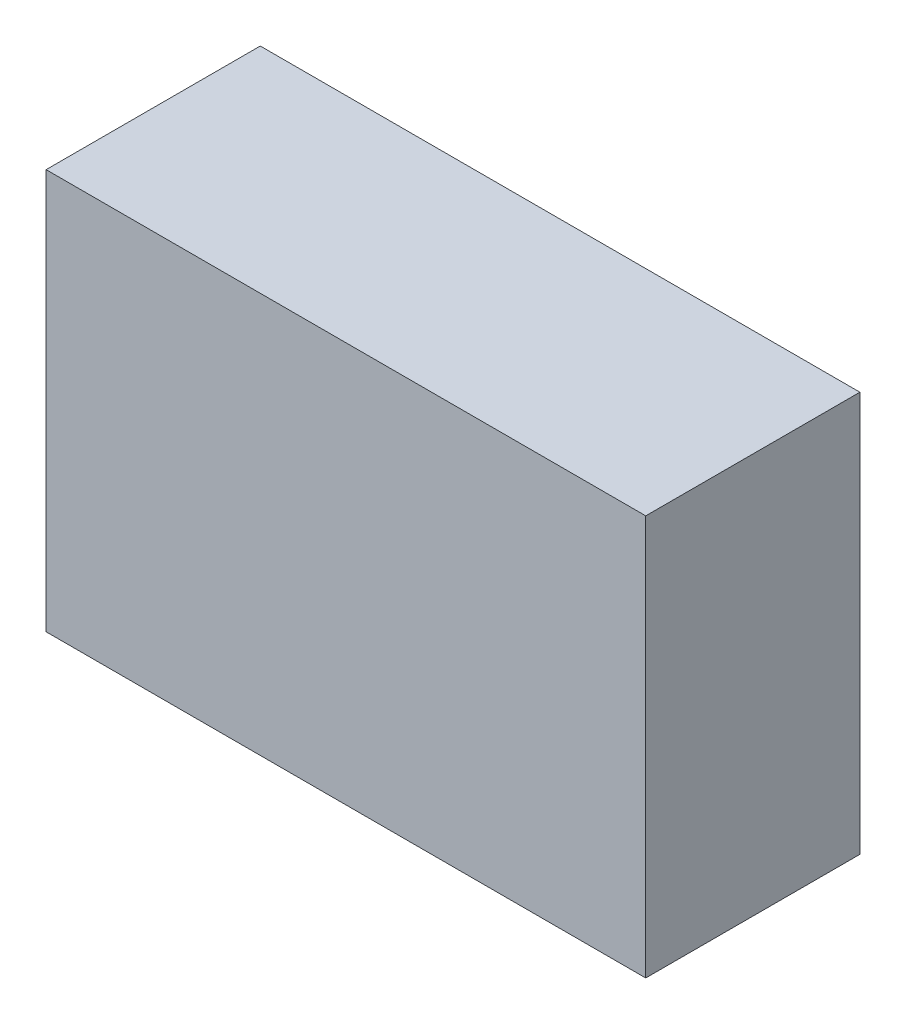
ISO-10303-21;
HEADER;
FILE_DESCRIPTION(('STEP AP214'),'2;1');
FILE_NAME('part.step','',(''),(''),'','','');
FILE_SCHEMA(('AUTOMOTIVE_DESIGN { 1 0 10303 214 1 1 1 1 }'));
ENDSEC;
DATA;
#1=APPLICATION_CONTEXT('core data for automotive mechanical design processes');
#2=APPLICATION_PROTOCOL_DEFINITION('international standard','automotive_design',2000,#1);
#3=PRODUCT_CONTEXT('',#1,'mechanical');
#4=PRODUCT('Part','Part','',(#3));
#5=PRODUCT_RELATED_PRODUCT_CATEGORY('part','',(#4));
#6=PRODUCT_DEFINITION_FORMATION('','',#4);
#7=PRODUCT_DEFINITION_CONTEXT('part definition',#1,'design');
#8=PRODUCT_DEFINITION('design','',#6,#7);
#9=PRODUCT_DEFINITION_SHAPE('','',#8);
#10=(LENGTH_UNIT() NAMED_UNIT(*) SI_UNIT(.MILLI.,.METRE.));
#11=(NAMED_UNIT(*) PLANE_ANGLE_UNIT() SI_UNIT($,.RADIAN.));
#12=(NAMED_UNIT(*) SI_UNIT($,.STERADIAN.) SOLID_ANGLE_UNIT());
#13=UNCERTAINTY_MEASURE_WITH_UNIT(LENGTH_MEASURE(1.E-05),#10,'distance_accuracy_value','');
#14=(GEOMETRIC_REPRESENTATION_CONTEXT(3) GLOBAL_UNCERTAINTY_ASSIGNED_CONTEXT((#13)) GLOBAL_UNIT_ASSIGNED_CONTEXT((#10,
#11,#12)) REPRESENTATION_CONTEXT('',''));
#15=CARTESIAN_POINT('',(0.,0.,0.));
#16=DIRECTION('',(0.,0.,1.));
#17=DIRECTION('',(1.,0.,0.));
#18=AXIS2_PLACEMENT_3D('',#15,#16,#17);
#19=CARTESIAN_POINT('',(4.0599995,-2.70999966,2.89999928));
#20=DIRECTION('',(0.,0.,-1.));
#21=DIRECTION('',(0.,-1.,0.));
#22=AXIS2_PLACEMENT_3D('',#19,#20,#21);
#23=PLANE('',#22);
#24=DIRECTION('',(0.,1.,0.));
#25=VECTOR('',#24,1.);
#26=CARTESIAN_POINT('',(4.0599995,-2.70999966,2.89999928));
#27=LINE('',#26,#25);
#28=CARTESIAN_POINT('',(4.0599995,-2.70999966,2.89999928));
#29=VERTEX_POINT('',#28);
#30=CARTESIAN_POINT('',(4.0599995,2.7100022,2.89999928));
#31=VERTEX_POINT('',#30);
#32=EDGE_CURVE('E81',#29,#31,#27,.T.);
#33=ORIENTED_EDGE('',*,*,#32,.T.);
#34=DIRECTION('',(-1.,0.,0.));
#35=VECTOR('',#34,1.);
#36=CARTESIAN_POINT('',(4.0599995,2.7100022,2.89999928));
#37=LINE('',#36,#35);
#38=CARTESIAN_POINT('',(-4.0599995,2.7100022,2.89999928));
#39=VERTEX_POINT('',#38);
#40=EDGE_CURVE('E104',#31,#39,#37,.T.);
#41=ORIENTED_EDGE('',*,*,#40,.T.);
#42=DIRECTION('',(0.,-1.,0.));
#43=VECTOR('',#42,1.);
#44=CARTESIAN_POINT('',(-4.0599995,2.7100022,2.89999928));
#45=LINE('',#44,#43);
#46=CARTESIAN_POINT('',(-4.0599995,-2.70999966,2.89999928));
#47=VERTEX_POINT('',#46);
#48=EDGE_CURVE('E74',#39,#47,#45,.T.);
#49=ORIENTED_EDGE('',*,*,#48,.T.);
#50=DIRECTION('',(1.,0.,0.));
#51=VECTOR('',#50,1.);
#52=CARTESIAN_POINT('',(-4.0599995,-2.70999966,2.89999928));
#53=LINE('',#52,#51);
#54=EDGE_CURVE('E11',#47,#29,#53,.T.);
#55=ORIENTED_EDGE('',*,*,#54,.T.);
#56=EDGE_LOOP('',(#33,#41,#49,#55));
#57=FACE_BOUND('',#56,.T.);
#58=ADVANCED_FACE('F17',(#57),#23,.F.);
#59=CARTESIAN_POINT('',(4.0599995,-2.70999966,0.));
#60=DIRECTION('',(0.,0.,-1.));
#61=DIRECTION('',(0.,-1.,0.));
#62=AXIS2_PLACEMENT_3D('',#59,#60,#61);
#63=PLANE('',#62);
#64=DIRECTION('',(1.,0.,0.));
#65=VECTOR('',#64,1.);
#66=CARTESIAN_POINT('',(-4.0599995,-2.70999966,0.));
#67=LINE('',#66,#65);
#68=CARTESIAN_POINT('',(-4.0599995,-2.70999966,0.));
#69=VERTEX_POINT('',#68);
#70=CARTESIAN_POINT('',(4.0599995,-2.70999966,0.));
#71=VERTEX_POINT('',#70);
#72=EDGE_CURVE('E25',#69,#71,#67,.T.);
#73=ORIENTED_EDGE('',*,*,#72,.F.);
#74=DIRECTION('',(0.,-1.,0.));
#75=VECTOR('',#74,1.);
#76=CARTESIAN_POINT('',(-4.0599995,2.7100022,0.));
#77=LINE('',#76,#75);
#78=CARTESIAN_POINT('',(-4.0599995,2.7100022,0.));
#79=VERTEX_POINT('',#78);
#80=EDGE_CURVE('E108',#79,#69,#77,.T.);
#81=ORIENTED_EDGE('',*,*,#80,.F.);
#82=DIRECTION('',(-1.,0.,0.));
#83=VECTOR('',#82,1.);
#84=CARTESIAN_POINT('',(4.0599995,2.7100022,0.));
#85=LINE('',#84,#83);
#86=CARTESIAN_POINT('',(4.0599995,2.7100022,0.));
#87=VERTEX_POINT('',#86);
#88=EDGE_CURVE('E83',#87,#79,#85,.T.);
#89=ORIENTED_EDGE('',*,*,#88,.F.);
#90=DIRECTION('',(0.,1.,0.));
#91=VECTOR('',#90,1.);
#92=CARTESIAN_POINT('',(4.0599995,-2.70999966,0.));
#93=LINE('',#92,#91);
#94=EDGE_CURVE('E79',#71,#87,#93,.T.);
#95=ORIENTED_EDGE('',*,*,#94,.F.);
#96=EDGE_LOOP('',(#73,#81,#89,#95));
#97=FACE_BOUND('',#96,.T.);
#98=ADVANCED_FACE('F85',(#97),#63,.T.);
#99=CARTESIAN_POINT('',(-4.0599995,-2.70999966,0.));
#100=DIRECTION('',(0.,1.,0.));
#101=DIRECTION('',(1.,0.,0.));
#102=AXIS2_PLACEMENT_3D('',#99,#100,#101);
#103=PLANE('',#102);
#104=ORIENTED_EDGE('',*,*,#72,.T.);
#105=DIRECTION('',(0.,0.,1.));
#106=VECTOR('',#105,1.);
#107=CARTESIAN_POINT('',(4.0599995,-2.70999966,0.));
#108=LINE('',#107,#106);
#109=EDGE_CURVE('E68',#71,#29,#108,.T.);
#110=ORIENTED_EDGE('',*,*,#109,.T.);
#111=ORIENTED_EDGE('',*,*,#54,.F.);
#112=DIRECTION('',(0.,0.,1.));
#113=VECTOR('',#112,1.);
#114=CARTESIAN_POINT('',(-4.0599995,-2.70999966,0.));
#115=LINE('',#114,#113);
#116=EDGE_CURVE('E71',#69,#47,#115,.T.);
#117=ORIENTED_EDGE('',*,*,#116,.F.);
#118=EDGE_LOOP('',(#104,#110,#111,#117));
#119=FACE_BOUND('',#118,.T.);
#120=ADVANCED_FACE('F67',(#119),#103,.F.);
#121=CARTESIAN_POINT('',(-4.0599995,2.7100022,0.));
#122=DIRECTION('',(1.,0.,0.));
#123=DIRECTION('',(0.,1.,0.));
#124=AXIS2_PLACEMENT_3D('',#121,#122,#123);
#125=PLANE('',#124);
#126=ORIENTED_EDGE('',*,*,#80,.T.);
#127=ORIENTED_EDGE('',*,*,#116,.T.);
#128=ORIENTED_EDGE('',*,*,#48,.F.);
#129=DIRECTION('',(0.,0.,1.));
#130=VECTOR('',#129,1.);
#131=CARTESIAN_POINT('',(-4.0599995,2.7100022,0.));
#132=LINE('',#131,#130);
#133=EDGE_CURVE('E97',#79,#39,#132,.T.);
#134=ORIENTED_EDGE('',*,*,#133,.F.);
#135=EDGE_LOOP('',(#126,#127,#128,#134));
#136=FACE_BOUND('',#135,.T.);
#137=ADVANCED_FACE('F119',(#136),#125,.F.);
#138=CARTESIAN_POINT('',(4.0599995,2.7100022,0.));
#139=DIRECTION('',(0.,-1.,0.));
#140=DIRECTION('',(0.,0.,-1.));
#141=AXIS2_PLACEMENT_3D('',#138,#139,#140);
#142=PLANE('',#141);
#143=ORIENTED_EDGE('',*,*,#88,.T.);
#144=ORIENTED_EDGE('',*,*,#133,.T.);
#145=ORIENTED_EDGE('',*,*,#40,.F.);
#146=DIRECTION('',(0.,0.,1.));
#147=VECTOR('',#146,1.);
#148=CARTESIAN_POINT('',(4.0599995,2.7100022,0.));
#149=LINE('',#148,#147);
#150=EDGE_CURVE('E89',#87,#31,#149,.T.);
#151=ORIENTED_EDGE('',*,*,#150,.F.);
#152=EDGE_LOOP('',(#143,#144,#145,#151));
#153=FACE_BOUND('',#152,.T.);
#154=ADVANCED_FACE('F123',(#153),#142,.F.);
#155=CARTESIAN_POINT('',(4.0599995,-2.70999966,0.));
#156=DIRECTION('',(-1.,0.,0.));
#157=DIRECTION('',(0.,0.,1.));
#158=AXIS2_PLACEMENT_3D('',#155,#156,#157);
#159=PLANE('',#158);
#160=ORIENTED_EDGE('',*,*,#94,.T.);
#161=ORIENTED_EDGE('',*,*,#150,.T.);
#162=ORIENTED_EDGE('',*,*,#32,.F.);
#163=ORIENTED_EDGE('',*,*,#109,.F.);
#164=EDGE_LOOP('',(#160,#161,#162,#163));
#165=FACE_BOUND('',#164,.T.);
#166=ADVANCED_FACE('F77',(#165),#159,.F.);
#167=CLOSED_SHELL('',(#58,#98,#120,#137,#154,#166));
#168=MANIFOLD_SOLID_BREP('B1',#167);
#169=ADVANCED_BREP_SHAPE_REPRESENTATION('',(#18,#168),#14);
#170=SHAPE_DEFINITION_REPRESENTATION(#9,#169);
ENDSEC;
END-ISO-10303-21;
